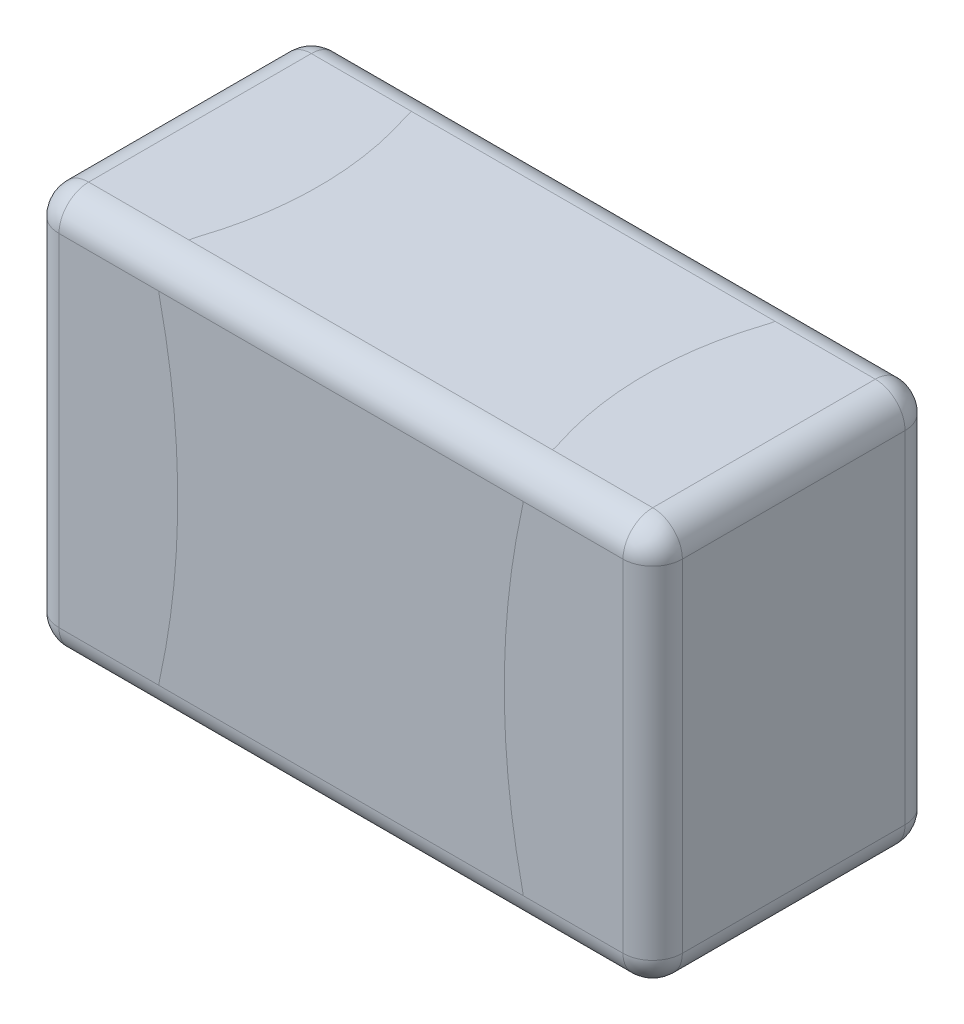
ISO-10303-21;
HEADER;
FILE_DESCRIPTION(('STEP AP214'),'2;1');
FILE_NAME('part.step','',(''),(''),'','','');
FILE_SCHEMA(('AUTOMOTIVE_DESIGN { 1 0 10303 214 1 1 1 1 }'));
ENDSEC;
DATA;
#1=APPLICATION_CONTEXT('core data for automotive mechanical design processes');
#2=APPLICATION_PROTOCOL_DEFINITION('international standard','automotive_design',2000,#1);
#3=PRODUCT_CONTEXT('',#1,'mechanical');
#4=PRODUCT('Part','Part','',(#3));
#5=PRODUCT_RELATED_PRODUCT_CATEGORY('part','',(#4));
#6=PRODUCT_DEFINITION_FORMATION('','',#4);
#7=PRODUCT_DEFINITION_CONTEXT('part definition',#1,'design');
#8=PRODUCT_DEFINITION('design','',#6,#7);
#9=PRODUCT_DEFINITION_SHAPE('','',#8);
#10=(LENGTH_UNIT() NAMED_UNIT(*) SI_UNIT(.MILLI.,.METRE.));
#11=(NAMED_UNIT(*) PLANE_ANGLE_UNIT() SI_UNIT($,.RADIAN.));
#12=(NAMED_UNIT(*) SI_UNIT($,.STERADIAN.) SOLID_ANGLE_UNIT());
#13=UNCERTAINTY_MEASURE_WITH_UNIT(LENGTH_MEASURE(1.E-05),#10,'distance_accuracy_value','');
#14=(GEOMETRIC_REPRESENTATION_CONTEXT(3) GLOBAL_UNCERTAINTY_ASSIGNED_CONTEXT((#13)) GLOBAL_UNIT_ASSIGNED_CONTEXT((#10,
#11,#12)) REPRESENTATION_CONTEXT('',''));
#15=CARTESIAN_POINT('',(0.,0.,0.));
#16=DIRECTION('',(0.,0.,1.));
#17=DIRECTION('',(1.,0.,0.));
#18=AXIS2_PLACEMENT_3D('',#15,#16,#17);
#19=CARTESIAN_POINT('',(0.95,0.575,0.85));
#20=DIRECTION('',(0.,0.,1.));
#21=DIRECTION('',(1.,0.,0.));
#22=AXIS2_PLACEMENT_3D('',#19,#20,#21);
#23=SPHERICAL_SURFACE('',#22,0.1);
#24=CARTESIAN_POINT('',(0.95,0.575,0.85));
#25=DIRECTION('',(0.,0.,-1.));
#26=DIRECTION('',(1.,0.,0.));
#27=AXIS2_PLACEMENT_3D('',#24,#25,#26);
#28=CIRCLE('',#27,0.1);
#29=CARTESIAN_POINT('',(0.95,0.675,0.85));
#30=VERTEX_POINT('',#29);
#31=CARTESIAN_POINT('',(1.05,0.575,0.85));
#32=VERTEX_POINT('',#31);
#33=EDGE_CURVE('E27',#30,#32,#28,.T.);
#34=ORIENTED_EDGE('',*,*,#33,.F.);
#35=CARTESIAN_POINT('',(0.95,0.575,0.85));
#36=DIRECTION('',(1.,0.,0.));
#37=DIRECTION('',(0.,0.,1.));
#38=AXIS2_PLACEMENT_3D('',#35,#36,#37);
#39=CIRCLE('',#38,0.1);
#40=CARTESIAN_POINT('',(0.95,0.575,0.95));
#41=VERTEX_POINT('',#40);
#42=EDGE_CURVE('E331',#30,#41,#39,.T.);
#43=ORIENTED_EDGE('',*,*,#42,.T.);
#44=CARTESIAN_POINT('',(0.95,0.575,0.85));
#45=DIRECTION('',(0.,-1.,0.));
#46=DIRECTION('',(0.,0.,1.));
#47=AXIS2_PLACEMENT_3D('',#44,#45,#46);
#48=CIRCLE('',#47,0.1);
#49=EDGE_CURVE('E11',#32,#41,#48,.T.);
#50=ORIENTED_EDGE('',*,*,#49,.F.);
#51=EDGE_LOOP('',(#34,#43,#50));
#52=FACE_BOUND('',#51,.T.);
#53=ADVANCED_FACE('F16',(#52),#23,.T.);
#54=CARTESIAN_POINT('',(-0.95,0.575,0.85));
#55=DIRECTION('',(0.,0.,1.));
#56=DIRECTION('',(0.,1.,0.));
#57=AXIS2_PLACEMENT_3D('',#54,#55,#56);
#58=SPHERICAL_SURFACE('',#57,0.1);
#59=CARTESIAN_POINT('',(-0.95,0.575,0.85));
#60=DIRECTION('',(0.,0.,-1.));
#61=DIRECTION('',(0.,1.,0.));
#62=AXIS2_PLACEMENT_3D('',#59,#60,#61);
#63=CIRCLE('',#62,0.1);
#64=CARTESIAN_POINT('',(-1.05,0.575,0.85));
#65=VERTEX_POINT('',#64);
#66=CARTESIAN_POINT('',(-0.95,0.675,0.85));
#67=VERTEX_POINT('',#66);
#68=EDGE_CURVE('E312',#65,#67,#63,.T.);
#69=ORIENTED_EDGE('',*,*,#68,.F.);
#70=CARTESIAN_POINT('',(-0.95,0.575,0.85));
#71=DIRECTION('',(0.,1.,0.));
#72=DIRECTION('',(0.,0.,1.));
#73=AXIS2_PLACEMENT_3D('',#70,#71,#72);
#74=CIRCLE('',#73,0.1);
#75=CARTESIAN_POINT('',(-0.95,0.575,0.95));
#76=VERTEX_POINT('',#75);
#77=EDGE_CURVE('E309',#65,#76,#74,.T.);
#78=ORIENTED_EDGE('',*,*,#77,.T.);
#79=CARTESIAN_POINT('',(-0.95,0.575,0.85));
#80=DIRECTION('',(1.,0.,0.));
#81=DIRECTION('',(0.,0.,1.));
#82=AXIS2_PLACEMENT_3D('',#79,#80,#81);
#83=CIRCLE('',#82,0.1);
#84=EDGE_CURVE('E313',#67,#76,#83,.T.);
#85=ORIENTED_EDGE('',*,*,#84,.F.);
#86=EDGE_LOOP('',(#69,#78,#85));
#87=FACE_BOUND('',#86,.T.);
#88=ADVANCED_FACE('F685',(#87),#58,.T.);
#89=CARTESIAN_POINT('',(0.95,-0.975,0.85));
#90=DIRECTION('',(0.,-1.,0.));
#91=DIRECTION('',(1.,0.,0.));
#92=AXIS2_PLACEMENT_3D('',#89,#90,#91);
#93=CYLINDRICAL_SURFACE('',#92,0.1);
#94=DIRECTION('',(0.,1.,0.));
#95=VECTOR('',#94,1.);
#96=CARTESIAN_POINT('',(0.95,-0.575,0.95));
#97=LINE('',#96,#95);
#98=CARTESIAN_POINT('',(0.95,-0.575,0.95));
#99=VERTEX_POINT('',#98);
#100=EDGE_CURVE('E299',#99,#41,#97,.T.);
#101=ORIENTED_EDGE('',*,*,#100,.F.);
#102=CARTESIAN_POINT('',(0.95,-0.575,0.85));
#103=DIRECTION('',(0.,-1.,0.));
#104=DIRECTION('',(0.,0.,1.));
#105=AXIS2_PLACEMENT_3D('',#102,#103,#104);
#106=CIRCLE('',#105,0.1);
#107=CARTESIAN_POINT('',(1.05,-0.575,0.85));
#108=VERTEX_POINT('',#107);
#109=EDGE_CURVE('E304',#108,#99,#106,.T.);
#110=ORIENTED_EDGE('',*,*,#109,.F.);
#111=DIRECTION('',(0.,1.,0.));
#112=VECTOR('',#111,1.);
#113=CARTESIAN_POINT('',(1.05,-0.575,0.85));
#114=LINE('',#113,#112);
#115=EDGE_CURVE('E371',#108,#32,#114,.T.);
#116=ORIENTED_EDGE('',*,*,#115,.T.);
#117=ORIENTED_EDGE('',*,*,#49,.T.);
#118=EDGE_LOOP('',(#101,#110,#116,#117));
#119=FACE_BOUND('',#118,.T.);
#120=ADVANCED_FACE('F690',(#119),#93,.T.);
#121=CARTESIAN_POINT('',(0.95,0.575,1.35));
#122=DIRECTION('',(0.,0.,-1.));
#123=DIRECTION('',(0.,1.,0.));
#124=AXIS2_PLACEMENT_3D('',#121,#122,#123);
#125=CYLINDRICAL_SURFACE('',#124,0.1);
#126=CARTESIAN_POINT('',(0.95,0.575,0.1));
#127=DIRECTION('',(0.,0.,1.));
#128=DIRECTION('',(0.,1.,0.));
#129=AXIS2_PLACEMENT_3D('',#126,#127,#128);
#130=CIRCLE('',#129,0.1);
#131=CARTESIAN_POINT('',(1.05,0.575,0.1));
#132=VERTEX_POINT('',#131);
#133=CARTESIAN_POINT('',(0.95,0.675,0.1));
#134=VERTEX_POINT('',#133);
#135=EDGE_CURVE('E372',#132,#134,#130,.T.);
#136=ORIENTED_EDGE('',*,*,#135,.T.);
#137=DIRECTION('',(0.,0.,-1.));
#138=VECTOR('',#137,1.);
#139=CARTESIAN_POINT('',(0.95,0.675,0.85));
#140=LINE('',#139,#138);
#141=EDGE_CURVE('E435',#30,#134,#140,.T.);
#142=ORIENTED_EDGE('',*,*,#141,.F.);
#143=ORIENTED_EDGE('',*,*,#33,.T.);
#144=DIRECTION('',(0.,0.,-1.));
#145=VECTOR('',#144,1.);
#146=CARTESIAN_POINT('',(1.05,0.575,0.85));
#147=LINE('',#146,#145);
#148=EDGE_CURVE('E368',#32,#132,#147,.T.);
#149=ORIENTED_EDGE('',*,*,#148,.T.);
#150=EDGE_LOOP('',(#136,#142,#143,#149));
#151=FACE_BOUND('',#150,.T.);
#152=ADVANCED_FACE('F696',(#151),#125,.T.);
#153=CARTESIAN_POINT('',(-0.95,0.575,-0.4));
#154=DIRECTION('',(0.,0.,1.));
#155=DIRECTION('',(0.,1.,0.));
#156=AXIS2_PLACEMENT_3D('',#153,#154,#155);
#157=CYLINDRICAL_SURFACE('',#156,0.1);
#158=CARTESIAN_POINT('',(-0.95,0.575,0.1));
#159=DIRECTION('',(0.,0.,1.));
#160=DIRECTION('',(-1.,0.,0.));
#161=AXIS2_PLACEMENT_3D('',#158,#159,#160);
#162=CIRCLE('',#161,0.1);
#163=CARTESIAN_POINT('',(-0.95,0.675,0.1));
#164=VERTEX_POINT('',#163);
#165=CARTESIAN_POINT('',(-1.05,0.575,0.1));
#166=VERTEX_POINT('',#165);
#167=EDGE_CURVE('E416',#164,#166,#162,.T.);
#168=ORIENTED_EDGE('',*,*,#167,.T.);
#169=DIRECTION('',(0.,0.,1.));
#170=VECTOR('',#169,1.);
#171=CARTESIAN_POINT('',(-1.05,0.575,0.1));
#172=LINE('',#171,#170);
#173=EDGE_CURVE('E420',#166,#65,#172,.T.);
#174=ORIENTED_EDGE('',*,*,#173,.T.);
#175=ORIENTED_EDGE('',*,*,#68,.T.);
#176=DIRECTION('',(0.,0.,1.));
#177=VECTOR('',#176,1.);
#178=CARTESIAN_POINT('',(-0.95,0.675,0.1));
#179=LINE('',#178,#177);
#180=EDGE_CURVE('E419',#164,#67,#179,.T.);
#181=ORIENTED_EDGE('',*,*,#180,.F.);
#182=EDGE_LOOP('',(#168,#174,#175,#181));
#183=FACE_BOUND('',#182,.T.);
#184=ADVANCED_FACE('F699',(#183),#157,.T.);
#185=CARTESIAN_POINT('',(-0.95,-0.975,0.85));
#186=DIRECTION('',(0.,-1.,0.));
#187=DIRECTION('',(0.,0.,1.));
#188=AXIS2_PLACEMENT_3D('',#185,#186,#187);
#189=CYLINDRICAL_SURFACE('',#188,0.1);
#190=DIRECTION('',(0.,1.,0.));
#191=VECTOR('',#190,1.);
#192=CARTESIAN_POINT('',(-1.05,-0.575,0.85));
#193=LINE('',#192,#191);
#194=CARTESIAN_POINT('',(-1.05,-0.575,0.85));
#195=VERTEX_POINT('',#194);
#196=EDGE_CURVE('E470',#195,#65,#193,.T.);
#197=ORIENTED_EDGE('',*,*,#196,.F.);
#198=CARTESIAN_POINT('',(-0.95,-0.575,0.85));
#199=DIRECTION('',(0.,1.,0.));
#200=DIRECTION('',(-1.,0.,0.));
#201=AXIS2_PLACEMENT_3D('',#198,#199,#200);
#202=CIRCLE('',#201,0.1);
#203=CARTESIAN_POINT('',(-0.95,-0.575,0.95));
#204=VERTEX_POINT('',#203);
#205=EDGE_CURVE('E474',#195,#204,#202,.T.);
#206=ORIENTED_EDGE('',*,*,#205,.T.);
#207=DIRECTION('',(0.,1.,0.));
#208=VECTOR('',#207,1.);
#209=CARTESIAN_POINT('',(-0.95,-0.575,0.95));
#210=LINE('',#209,#208);
#211=EDGE_CURVE('E277',#204,#76,#210,.T.);
#212=ORIENTED_EDGE('',*,*,#211,.T.);
#213=ORIENTED_EDGE('',*,*,#77,.F.);
#214=EDGE_LOOP('',(#197,#206,#212,#213));
#215=FACE_BOUND('',#214,.T.);
#216=ADVANCED_FACE('F650',(#215),#189,.T.);
#217=CARTESIAN_POINT('',(-1.35,0.575,0.85));
#218=DIRECTION('',(1.,0.,0.));
#219=DIRECTION('',(0.,1.,0.));
#220=AXIS2_PLACEMENT_3D('',#217,#218,#219);
#221=CYLINDRICAL_SURFACE('',#220,0.1);
#222=DIRECTION('',(1.,0.,0.));
#223=VECTOR('',#222,1.);
#224=CARTESIAN_POINT('',(-0.613766216345116,0.575,0.95));
#225=LINE('',#224,#223);
#226=CARTESIAN_POINT('',(-0.613766217860381,0.575000000161156,0.95));
#227=VERTEX_POINT('',#226);
#228=CARTESIAN_POINT('',(0.613766217734058,0.575000000162141,0.95));
#229=VERTEX_POINT('',#228);
#230=EDGE_CURVE('E318',#227,#229,#225,.T.);
#231=ORIENTED_EDGE('',*,*,#230,.T.);
#232=DIRECTION('',(1.,0.,0.));
#233=VECTOR('',#232,1.);
#234=CARTESIAN_POINT('',(0.613767345066621,0.575,0.95));
#235=LINE('',#234,#233);
#236=EDGE_CURVE('E303',#229,#41,#235,.T.);
#237=ORIENTED_EDGE('',*,*,#236,.T.);
#238=ORIENTED_EDGE('',*,*,#42,.F.);
#239=DIRECTION('',(1.,0.,0.));
#240=VECTOR('',#239,1.);
#241=CARTESIAN_POINT('',(0.61222652541798,0.675,0.85));
#242=LINE('',#241,#240);
#243=CARTESIAN_POINT('',(0.612225614374475,0.675,0.850000000332777));
#244=VERTEX_POINT('',#243);
#245=EDGE_CURVE('E439',#244,#30,#242,.T.);
#246=ORIENTED_EDGE('',*,*,#245,.F.);
#247=DIRECTION('',(1.,0.,0.));
#248=VECTOR('',#247,1.);
#249=CARTESIAN_POINT('',(-0.61222561240207,0.675,0.85));
#250=LINE('',#249,#248);
#251=CARTESIAN_POINT('',(-0.612225614631557,0.675,0.850000000337919));
#252=VERTEX_POINT('',#251);
#253=EDGE_CURVE('E423',#252,#244,#250,.T.);
#254=ORIENTED_EDGE('',*,*,#253,.F.);
#255=DIRECTION('',(1.,0.,0.));
#256=VECTOR('',#255,1.);
#257=CARTESIAN_POINT('',(-0.95,0.675,0.85));
#258=LINE('',#257,#256);
#259=EDGE_CURVE('E440',#67,#252,#258,.T.);
#260=ORIENTED_EDGE('',*,*,#259,.F.);
#261=ORIENTED_EDGE('',*,*,#84,.T.);
#262=DIRECTION('',(1.,0.,0.));
#263=VECTOR('',#262,1.);
#264=CARTESIAN_POINT('',(-0.95,0.575,0.95));
#265=LINE('',#264,#263);
#266=EDGE_CURVE('E269',#76,#227,#265,.T.);
#267=ORIENTED_EDGE('',*,*,#266,.T.);
#268=EDGE_LOOP('',(#231,#237,#238,#246,#254,#260,#261,#267));
#269=FACE_BOUND('',#268,.T.);
#270=ADVANCED_FACE('F642',(#269),#221,.T.);
#271=CARTESIAN_POINT('',(-1.05,-0.675,0.95));
#272=DIRECTION('',(0.,0.,1.));
#273=DIRECTION('',(1.,0.,0.));
#274=AXIS2_PLACEMENT_3D('',#271,#272,#273);
#275=PLANE('',#274);
#276=CARTESIAN_POINT('',(0.415000000043602,-0.597180878357803,0.95));
#277=DIRECTION('',(0.,0.,1.));
#278=DIRECTION('',(0.993831080154927,0.110904391789016,0.));
#279=AXIS2_PLACEMENT_3D('',#276,#277,#278);
#280=CIRCLE('',#279,0.2);
#281=CARTESIAN_POINT('',(0.613766217595116,-0.575000000161716,0.95));
#282=VERTEX_POINT('',#281);
#283=CARTESIAN_POINT('',(0.610316613749289,-0.554152742734599,0.95));
#284=VERTEX_POINT('',#283);
#285=EDGE_CURVE('E463',#282,#284,#280,.T.);
#286=ORIENTED_EDGE('',*,*,#285,.F.);
#287=DIRECTION('',(1.,0.,0.));
#288=VECTOR('',#287,1.);
#289=CARTESIAN_POINT('',(0.613767341970685,-0.575,0.95));
#290=LINE('',#289,#288);
#291=EDGE_CURVE('E20',#282,#99,#290,.T.);
#292=ORIENTED_EDGE('',*,*,#291,.T.);
#293=ORIENTED_EDGE('',*,*,#100,.T.);
#294=ORIENTED_EDGE('',*,*,#236,.F.);
#295=CARTESIAN_POINT('',(0.415000000043602,0.597180877148546,0.95));
#296=DIRECTION('',(0.,0.,1.));
#297=DIRECTION('',(0.976583067458364,-0.215140680378239,0.));
#298=AXIS2_PLACEMENT_3D('',#295,#296,#297);
#299=CIRCLE('',#298,0.2);
#300=CARTESIAN_POINT('',(0.610316613517289,0.554152741076861,0.95));
#301=VERTEX_POINT('',#300);
#302=EDGE_CURVE('E314',#301,#229,#299,.T.);
#303=ORIENTED_EDGE('',*,*,#302,.F.);
#304=CARTESIAN_POINT('',(3.12576923076923,0.,0.95));
#305=DIRECTION('',(0.,0.,-1.));
#306=DIRECTION('',(-0.976583067637498,-0.215140679565103,0.));
#307=AXIS2_PLACEMENT_3D('',#304,#305,#306);
#308=CIRCLE('',#307,2.57576923076923);
#309=EDGE_CURVE('E319',#284,#301,#308,.T.);
#310=ORIENTED_EDGE('',*,*,#309,.F.);
#311=EDGE_LOOP('',(#286,#292,#293,#294,#303,#310));
#312=FACE_BOUND('',#311,.T.);
#313=ADVANCED_FACE('F723',(#312),#275,.T.);
#314=CARTESIAN_POINT('',(0.95,-0.575,0.85));
#315=DIRECTION('',(0.,0.,1.));
#316=DIRECTION('',(0.,-1.,0.));
#317=AXIS2_PLACEMENT_3D('',#314,#315,#316);
#318=SPHERICAL_SURFACE('',#317,0.1);
#319=ORIENTED_EDGE('',*,*,#109,.T.);
#320=CARTESIAN_POINT('',(0.95,-0.575,0.85));
#321=DIRECTION('',(-1.,0.,0.));
#322=DIRECTION('',(0.,0.,1.));
#323=AXIS2_PLACEMENT_3D('',#320,#321,#322);
#324=CIRCLE('',#323,0.1);
#325=CARTESIAN_POINT('',(0.95,-0.675,0.85));
#326=VERTEX_POINT('',#325);
#327=EDGE_CURVE('E294',#326,#99,#324,.T.);
#328=ORIENTED_EDGE('',*,*,#327,.F.);
#329=CARTESIAN_POINT('',(0.95,-0.575,0.85));
#330=DIRECTION('',(0.,0.,-1.));
#331=DIRECTION('',(0.,-1.,0.));
#332=AXIS2_PLACEMENT_3D('',#329,#330,#331);
#333=CIRCLE('',#332,0.1);
#334=EDGE_CURVE('E480',#108,#326,#333,.T.);
#335=ORIENTED_EDGE('',*,*,#334,.F.);
#336=EDGE_LOOP('',(#319,#328,#335));
#337=FACE_BOUND('',#336,.T.);
#338=ADVANCED_FACE('F748',(#337),#318,.T.);
#339=CARTESIAN_POINT('',(1.05,-0.675,0.95));
#340=DIRECTION('',(1.,0.,0.));
#341=DIRECTION('',(0.,1.,0.));
#342=AXIS2_PLACEMENT_3D('',#339,#340,#341);
#343=PLANE('',#342);
#344=DIRECTION('',(0.,1.,0.));
#345=VECTOR('',#344,1.);
#346=CARTESIAN_POINT('',(1.05,-0.575,0.1));
#347=LINE('',#346,#345);
#348=CARTESIAN_POINT('',(1.05,-0.575,0.1));
#349=VERTEX_POINT('',#348);
#350=EDGE_CURVE('E323',#349,#132,#347,.T.);
#351=ORIENTED_EDGE('',*,*,#350,.T.);
#352=ORIENTED_EDGE('',*,*,#148,.F.);
#353=ORIENTED_EDGE('',*,*,#115,.F.);
#354=DIRECTION('',(0.,0.,-1.));
#355=VECTOR('',#354,1.);
#356=CARTESIAN_POINT('',(1.05,-0.575,0.85));
#357=LINE('',#356,#355);
#358=EDGE_CURVE('E393',#108,#349,#357,.T.);
#359=ORIENTED_EDGE('',*,*,#358,.T.);
#360=EDGE_LOOP('',(#351,#352,#353,#359));
#361=FACE_BOUND('',#360,.T.);
#362=ADVANCED_FACE('F1136',(#361),#343,.T.);
#363=CARTESIAN_POINT('',(0.95,0.575,0.1));
#364=DIRECTION('',(0.,0.,-1.));
#365=DIRECTION('',(0.,1.,0.));
#366=AXIS2_PLACEMENT_3D('',#363,#364,#365);
#367=SPHERICAL_SURFACE('',#366,0.1);
#368=CARTESIAN_POINT('',(0.95,0.575,0.1));
#369=DIRECTION('',(0.,1.,0.));
#370=DIRECTION('',(0.,0.,-1.));
#371=AXIS2_PLACEMENT_3D('',#368,#369,#370);
#372=CIRCLE('',#371,0.1);
#373=CARTESIAN_POINT('',(0.95,0.575,0.));
#374=VERTEX_POINT('',#373);
#375=EDGE_CURVE('E327',#132,#374,#372,.T.);
#376=ORIENTED_EDGE('',*,*,#375,.T.);
#377=CARTESIAN_POINT('',(0.95,0.575,0.1));
#378=DIRECTION('',(-1.,0.,0.));
#379=DIRECTION('',(0.,0.,-1.));
#380=AXIS2_PLACEMENT_3D('',#377,#378,#379);
#381=CIRCLE('',#380,0.1);
#382=EDGE_CURVE('E375',#134,#374,#381,.T.);
#383=ORIENTED_EDGE('',*,*,#382,.F.);
#384=ORIENTED_EDGE('',*,*,#135,.F.);
#385=EDGE_LOOP('',(#376,#383,#384));
#386=FACE_BOUND('',#385,.T.);
#387=ADVANCED_FACE('F704',(#386),#367,.T.);
#388=CARTESIAN_POINT('',(0.,0.675,0.));
#389=DIRECTION('',(0.,1.,0.));
#390=DIRECTION('',(1.,0.,0.));
#391=AXIS2_PLACEMENT_3D('',#388,#389,#390);
#392=PLANE('',#391);
#393=CARTESIAN_POINT('',(0.414999999998827,0.675,0.0668027437069124));
#394=DIRECTION('',(0.,-1.,0.));
#395=DIRECTION('',(0.9861280618486,0.,0.165986281465438));
#396=AXIS2_PLACEMENT_3D('',#393,#394,#395);
#397=CIRCLE('',#396,0.2);
#398=CARTESIAN_POINT('',(0.612225614598033,0.675,0.0999999996620809));
#399=VERTEX_POINT('',#398);
#400=CARTESIAN_POINT('',(0.60510828215951,0.675,0.128922314355596));
#401=VERTEX_POINT('',#400);
#402=EDGE_CURVE('E411',#399,#401,#397,.T.);
#403=ORIENTED_EDGE('',*,*,#402,.T.);
#404=CARTESIAN_POINT('',(1.66423076923077,0.675,0.475));
#405=DIRECTION('',(0.,1.,0.));
#406=DIRECTION('',(-0.950541410549756,0.,-0.310597853872301));
#407=AXIS2_PLACEMENT_3D('',#404,#405,#406);
#408=CIRCLE('',#407,1.11423076923077);
#409=CARTESIAN_POINT('',(0.6051082823478,0.675,0.821077686783946));
#410=VERTEX_POINT('',#409);
#411=EDGE_CURVE('E414',#401,#410,#408,.T.);
#412=ORIENTED_EDGE('',*,*,#411,.T.);
#413=CARTESIAN_POINT('',(0.414999999998827,0.675,0.883197257419703));
#414=DIRECTION('',(0.,-1.,0.));
#415=DIRECTION('',(0.950541410869801,0.,-0.31059785289285));
#416=AXIS2_PLACEMENT_3D('',#413,#414,#415);
#417=CIRCLE('',#416,0.2);
#418=EDGE_CURVE('E427',#410,#244,#417,.T.);
#419=ORIENTED_EDGE('',*,*,#418,.T.);
#420=ORIENTED_EDGE('',*,*,#245,.T.);
#421=ORIENTED_EDGE('',*,*,#141,.T.);
#422=DIRECTION('',(-1.,0.,0.));
#423=VECTOR('',#422,1.);
#424=CARTESIAN_POINT('',(0.95,0.675,0.1));
#425=LINE('',#424,#423);
#426=EDGE_CURVE('E390',#134,#399,#425,.T.);
#427=ORIENTED_EDGE('',*,*,#426,.T.);
#428=EDGE_LOOP('',(#403,#412,#419,#420,#421,#427));
#429=FACE_BOUND('',#428,.T.);
#430=ADVANCED_FACE('F701',(#429),#392,.T.);
#431=CARTESIAN_POINT('',(0.,0.675,0.));
#432=DIRECTION('',(0.,1.,0.));
#433=DIRECTION('',(1.,0.,0.));
#434=AXIS2_PLACEMENT_3D('',#431,#432,#433);
#435=PLANE('',#434);
#436=CARTESIAN_POINT('',(-0.415000000031313,0.675,0.883197256286924));
#437=DIRECTION('',(0.,-1.,0.));
#438=DIRECTION('',(-0.986128061853787,0.,-0.165986281434622));
#439=AXIS2_PLACEMENT_3D('',#436,#437,#438);
#440=CIRCLE('',#439,0.2);
#441=CARTESIAN_POINT('',(-0.605108282081708,0.675,0.821077685353512));
#442=VERTEX_POINT('',#441);
#443=EDGE_CURVE('E428',#252,#442,#440,.T.);
#444=ORIENTED_EDGE('',*,*,#443,.T.);
#445=CARTESIAN_POINT('',(-1.66423076923077,0.675,0.475));
#446=DIRECTION('',(0.,1.,0.));
#447=DIRECTION('',(0.95054141063357,0.,0.310597853615802));
#448=AXIS2_PLACEMENT_3D('',#445,#446,#447);
#449=CIRCLE('',#448,1.11423076923077);
#450=CARTESIAN_POINT('',(-0.6051082825548,0.675,0.128922312122949));
#451=VERTEX_POINT('',#450);
#452=EDGE_CURVE('E465',#442,#451,#449,.T.);
#453=ORIENTED_EDGE('',*,*,#452,.T.);
#454=CARTESIAN_POINT('',(-0.415000000031312,0.675,0.0668027415616645));
#455=DIRECTION('',(0.,-1.,0.));
#456=DIRECTION('',(-0.950541411063914,0.,0.310597852298795));
#457=AXIS2_PLACEMENT_3D('',#454,#455,#456);
#458=CIRCLE('',#457,0.2);
#459=CARTESIAN_POINT('',(-0.612225614235502,0.675,0.0999999996672228));
#460=VERTEX_POINT('',#459);
#461=EDGE_CURVE('E413',#451,#460,#458,.T.);
#462=ORIENTED_EDGE('',*,*,#461,.T.);
#463=DIRECTION('',(-1.,0.,0.));
#464=VECTOR('',#463,1.);
#465=CARTESIAN_POINT('',(-0.612226525278894,0.675,0.1));
#466=LINE('',#465,#464);
#467=EDGE_CURVE('E385',#460,#164,#466,.T.);
#468=ORIENTED_EDGE('',*,*,#467,.T.);
#469=ORIENTED_EDGE('',*,*,#180,.T.);
#470=ORIENTED_EDGE('',*,*,#259,.T.);
#471=EDGE_LOOP('',(#444,#453,#462,#468,#469,#470));
#472=FACE_BOUND('',#471,.T.);
#473=ADVANCED_FACE('F695',(#472),#435,.T.);
#474=CARTESIAN_POINT('',(-0.95,0.575,0.1));
#475=DIRECTION('',(0.,0.,-1.));
#476=DIRECTION('',(-1.,0.,0.));
#477=AXIS2_PLACEMENT_3D('',#474,#475,#476);
#478=SPHERICAL_SURFACE('',#477,0.1);
#479=CARTESIAN_POINT('',(-0.95,0.575,0.1));
#480=DIRECTION('',(-1.,0.,0.));
#481=DIRECTION('',(0.,0.,-1.));
#482=AXIS2_PLACEMENT_3D('',#479,#480,#481);
#483=CIRCLE('',#482,0.1);
#484=CARTESIAN_POINT('',(-0.95,0.575,0.));
#485=VERTEX_POINT('',#484);
#486=EDGE_CURVE('E382',#164,#485,#483,.T.);
#487=ORIENTED_EDGE('',*,*,#486,.T.);
#488=CARTESIAN_POINT('',(-0.95,0.575,0.1));
#489=DIRECTION('',(0.,-1.,0.));
#490=DIRECTION('',(0.,0.,-1.));
#491=AXIS2_PLACEMENT_3D('',#488,#489,#490);
#492=CIRCLE('',#491,0.1);
#493=EDGE_CURVE('E78',#166,#485,#492,.T.);
#494=ORIENTED_EDGE('',*,*,#493,.F.);
#495=ORIENTED_EDGE('',*,*,#167,.F.);
#496=EDGE_LOOP('',(#487,#494,#495));
#497=FACE_BOUND('',#496,.T.);
#498=ADVANCED_FACE('F658',(#497),#478,.T.);
#499=CARTESIAN_POINT('',(-1.05,-0.675,0.));
#500=DIRECTION('',(-1.,0.,0.));
#501=DIRECTION('',(0.,0.,1.));
#502=AXIS2_PLACEMENT_3D('',#499,#500,#501);
#503=PLANE('',#502);
#504=DIRECTION('',(0.,1.,0.));
#505=VECTOR('',#504,1.);
#506=CARTESIAN_POINT('',(-1.05,-0.575,0.1));
#507=LINE('',#506,#505);
#508=CARTESIAN_POINT('',(-1.05,-0.575,0.1));
#509=VERTEX_POINT('',#508);
#510=EDGE_CURVE('E93',#509,#166,#507,.T.);
#511=ORIENTED_EDGE('',*,*,#510,.F.);
#512=DIRECTION('',(0.,0.,1.));
#513=VECTOR('',#512,1.);
#514=CARTESIAN_POINT('',(-1.05,-0.575,0.1));
#515=LINE('',#514,#513);
#516=EDGE_CURVE('E305',#509,#195,#515,.T.);
#517=ORIENTED_EDGE('',*,*,#516,.T.);
#518=ORIENTED_EDGE('',*,*,#196,.T.);
#519=ORIENTED_EDGE('',*,*,#173,.F.);
#520=EDGE_LOOP('',(#511,#517,#518,#519));
#521=FACE_BOUND('',#520,.T.);
#522=ADVANCED_FACE('F654',(#521),#503,.T.);
#523=CARTESIAN_POINT('',(-0.95,-0.575,0.85));
#524=DIRECTION('',(0.,0.,1.));
#525=DIRECTION('',(-1.,0.,0.));
#526=AXIS2_PLACEMENT_3D('',#523,#524,#525);
#527=SPHERICAL_SURFACE('',#526,0.1);
#528=ORIENTED_EDGE('',*,*,#205,.F.);
#529=CARTESIAN_POINT('',(-0.95,-0.575,0.85));
#530=DIRECTION('',(0.,0.,-1.));
#531=DIRECTION('',(-1.,0.,0.));
#532=AXIS2_PLACEMENT_3D('',#529,#530,#531);
#533=CIRCLE('',#532,0.1);
#534=CARTESIAN_POINT('',(-0.95,-0.675,0.85));
#535=VERTEX_POINT('',#534);
#536=EDGE_CURVE('E308',#535,#195,#533,.T.);
#537=ORIENTED_EDGE('',*,*,#536,.F.);
#538=CARTESIAN_POINT('',(-0.95,-0.575,0.85));
#539=DIRECTION('',(-1.,0.,0.));
#540=DIRECTION('',(0.,0.,1.));
#541=AXIS2_PLACEMENT_3D('',#538,#539,#540);
#542=CIRCLE('',#541,0.1);
#543=EDGE_CURVE('E282',#535,#204,#542,.T.);
#544=ORIENTED_EDGE('',*,*,#543,.T.);
#545=EDGE_LOOP('',(#528,#537,#544));
#546=FACE_BOUND('',#545,.T.);
#547=ADVANCED_FACE('F653',(#546),#527,.T.);
#548=CARTESIAN_POINT('',(-1.05,-0.675,0.95));
#549=DIRECTION('',(0.,0.,1.));
#550=DIRECTION('',(1.,0.,0.));
#551=AXIS2_PLACEMENT_3D('',#548,#549,#550);
#552=PLANE('',#551);
#553=CARTESIAN_POINT('',(-0.415000000002069,-0.597180877121063,0.95));
#554=DIRECTION('',(0.,0.,-1.));
#555=DIRECTION('',(-0.993831080844983,0.110904385605315,0.));
#556=AXIS2_PLACEMENT_3D('',#553,#554,#555);
#557=CIRCLE('',#556,0.2);
#558=CARTESIAN_POINT('',(-0.613766217688978,-0.575000000161438,0.95));
#559=VERTEX_POINT('',#558);
#560=CARTESIAN_POINT('',(-0.610316613528899,-0.554152741210082,0.95));
#561=VERTEX_POINT('',#560);
#562=EDGE_CURVE('E257',#559,#561,#557,.T.);
#563=ORIENTED_EDGE('',*,*,#562,.T.);
#564=CARTESIAN_POINT('',(-3.12576923076923,0.,0.95));
#565=DIRECTION('',(0.,0.,1.));
#566=DIRECTION('',(0.976583067765811,-0.215140678982653,0.));
#567=AXIS2_PLACEMENT_3D('',#564,#565,#566);
#568=CIRCLE('',#567,2.57576923076923);
#569=CARTESIAN_POINT('',(-0.610316613313216,0.554152739451194,0.95));
#570=VERTEX_POINT('',#569);
#571=EDGE_CURVE('E266',#561,#570,#568,.T.);
#572=ORIENTED_EDGE('',*,*,#571,.T.);
#573=CARTESIAN_POINT('',(-0.415000000002069,0.597180875561375,0.95));
#574=DIRECTION('',(0.,0.,-1.));
#575=DIRECTION('',(-0.976583067380308,-0.215140680732559,0.));
#576=AXIS2_PLACEMENT_3D('',#573,#574,#575);
#577=CIRCLE('',#576,0.2);
#578=EDGE_CURVE('E404',#570,#227,#577,.T.);
#579=ORIENTED_EDGE('',*,*,#578,.T.);
#580=ORIENTED_EDGE('',*,*,#266,.F.);
#581=ORIENTED_EDGE('',*,*,#211,.F.);
#582=DIRECTION('',(1.,0.,0.));
#583=VECTOR('',#582,1.);
#584=CARTESIAN_POINT('',(-0.95,-0.575,0.95));
#585=LINE('',#584,#583);
#586=EDGE_CURVE('E273',#204,#559,#585,.T.);
#587=ORIENTED_EDGE('',*,*,#586,.T.);
#588=EDGE_LOOP('',(#563,#572,#579,#580,#581,#587));
#589=FACE_BOUND('',#588,.T.);
#590=ADVANCED_FACE('F274',(#589),#552,.T.);
#591=CARTESIAN_POINT('',(-1.05,-0.675,0.95));
#592=DIRECTION('',(0.,0.,1.));
#593=DIRECTION('',(1.,0.,0.));
#594=AXIS2_PLACEMENT_3D('',#591,#592,#593);
#595=PLANE('',#594);
#596=ORIENTED_EDGE('',*,*,#285,.T.);
#597=ORIENTED_EDGE('',*,*,#309,.T.);
#598=ORIENTED_EDGE('',*,*,#302,.T.);
#599=ORIENTED_EDGE('',*,*,#230,.F.);
#600=ORIENTED_EDGE('',*,*,#578,.F.);
#601=ORIENTED_EDGE('',*,*,#571,.F.);
#602=ORIENTED_EDGE('',*,*,#562,.F.);
#603=DIRECTION('',(1.,0.,0.));
#604=VECTOR('',#603,1.);
#605=CARTESIAN_POINT('',(-0.613766216171066,-0.575,0.95));
#606=LINE('',#605,#604);
#607=EDGE_CURVE('E262',#559,#282,#606,.T.);
#608=ORIENTED_EDGE('',*,*,#607,.T.);
#609=EDGE_LOOP('',(#596,#597,#598,#599,#600,#601,#602,#608));
#610=FACE_BOUND('',#609,.T.);
#611=ADVANCED_FACE('F260',(#610),#595,.T.);
#612=CARTESIAN_POINT('',(0.,0.675,0.));
#613=DIRECTION('',(0.,1.,0.));
#614=DIRECTION('',(1.,0.,0.));
#615=AXIS2_PLACEMENT_3D('',#612,#613,#614);
#616=PLANE('',#615);
#617=ORIENTED_EDGE('',*,*,#443,.F.);
#618=ORIENTED_EDGE('',*,*,#253,.T.);
#619=ORIENTED_EDGE('',*,*,#418,.F.);
#620=ORIENTED_EDGE('',*,*,#411,.F.);
#621=ORIENTED_EDGE('',*,*,#402,.F.);
#622=DIRECTION('',(-1.,0.,0.));
#623=VECTOR('',#622,1.);
#624=CARTESIAN_POINT('',(0.612225612368547,0.675,0.1));
#625=LINE('',#624,#623);
#626=EDGE_CURVE('E432',#399,#460,#625,.T.);
#627=ORIENTED_EDGE('',*,*,#626,.T.);
#628=ORIENTED_EDGE('',*,*,#461,.F.);
#629=ORIENTED_EDGE('',*,*,#452,.F.);
#630=EDGE_LOOP('',(#617,#618,#619,#620,#621,#627,#628,#629));
#631=FACE_BOUND('',#630,.T.);
#632=ADVANCED_FACE('F733',(#631),#616,.T.);
#633=CARTESIAN_POINT('',(0.95,-0.575,1.35));
#634=DIRECTION('',(0.,0.,1.));
#635=DIRECTION('',(0.,-1.,0.));
#636=AXIS2_PLACEMENT_3D('',#633,#634,#635);
#637=CYLINDRICAL_SURFACE('',#636,0.1);
#638=CARTESIAN_POINT('',(0.95,-0.575,0.1));
#639=DIRECTION('',(0.,0.,1.));
#640=DIRECTION('',(1.,0.,0.));
#641=AXIS2_PLACEMENT_3D('',#638,#639,#640);
#642=CIRCLE('',#641,0.1);
#643=CARTESIAN_POINT('',(0.95,-0.675,0.1));
#644=VERTEX_POINT('',#643);
#645=EDGE_CURVE('E405',#644,#349,#642,.T.);
#646=ORIENTED_EDGE('',*,*,#645,.T.);
#647=ORIENTED_EDGE('',*,*,#358,.F.);
#648=ORIENTED_EDGE('',*,*,#334,.T.);
#649=DIRECTION('',(0.,0.,-1.));
#650=VECTOR('',#649,1.);
#651=CARTESIAN_POINT('',(0.95,-0.675,0.85));
#652=LINE('',#651,#650);
#653=EDGE_CURVE('E455',#326,#644,#652,.T.);
#654=ORIENTED_EDGE('',*,*,#653,.T.);
#655=EDGE_LOOP('',(#646,#647,#648,#654));
#656=FACE_BOUND('',#655,.T.);
#657=ADVANCED_FACE('F730',(#656),#637,.T.);
#658=CARTESIAN_POINT('',(0.95,-0.975,0.1));
#659=DIRECTION('',(0.,-1.,0.));
#660=DIRECTION('',(0.,0.,-1.));
#661=AXIS2_PLACEMENT_3D('',#658,#659,#660);
#662=CYLINDRICAL_SURFACE('',#661,0.1);
#663=ORIENTED_EDGE('',*,*,#350,.F.);
#664=CARTESIAN_POINT('',(0.95,-0.575,0.1));
#665=DIRECTION('',(0.,1.,0.));
#666=DIRECTION('',(1.,0.,0.));
#667=AXIS2_PLACEMENT_3D('',#664,#665,#666);
#668=CIRCLE('',#667,0.1);
#669=CARTESIAN_POINT('',(0.95,-0.575,0.));
#670=VERTEX_POINT('',#669);
#671=EDGE_CURVE('E409',#349,#670,#668,.T.);
#672=ORIENTED_EDGE('',*,*,#671,.T.);
#673=DIRECTION('',(0.,1.,0.));
#674=VECTOR('',#673,1.);
#675=CARTESIAN_POINT('',(0.95,-0.575,0.));
#676=LINE('',#675,#674);
#677=EDGE_CURVE('E410',#670,#374,#676,.T.);
#678=ORIENTED_EDGE('',*,*,#677,.T.);
#679=ORIENTED_EDGE('',*,*,#375,.F.);
#680=EDGE_LOOP('',(#663,#672,#678,#679));
#681=FACE_BOUND('',#680,.T.);
#682=ADVANCED_FACE('F732',(#681),#662,.T.);
#683=CARTESIAN_POINT('',(-0.95,-0.975,0.1));
#684=DIRECTION('',(0.,-1.,0.));
#685=DIRECTION('',(-1.,0.,0.));
#686=AXIS2_PLACEMENT_3D('',#683,#684,#685);
#687=CYLINDRICAL_SURFACE('',#686,0.1);
#688=DIRECTION('',(0.,1.,0.));
#689=VECTOR('',#688,1.);
#690=CARTESIAN_POINT('',(-0.95,-0.575,0.));
#691=LINE('',#690,#689);
#692=CARTESIAN_POINT('',(-0.95,-0.575,0.));
#693=VERTEX_POINT('',#692);
#694=EDGE_CURVE('E454',#693,#485,#691,.T.);
#695=ORIENTED_EDGE('',*,*,#694,.F.);
#696=CARTESIAN_POINT('',(-0.95,-0.575,0.1));
#697=DIRECTION('',(0.,-1.,0.));
#698=DIRECTION('',(0.,0.,-1.));
#699=AXIS2_PLACEMENT_3D('',#696,#697,#698);
#700=CIRCLE('',#699,0.1);
#701=EDGE_CURVE('E529',#509,#693,#700,.T.);
#702=ORIENTED_EDGE('',*,*,#701,.F.);
#703=ORIENTED_EDGE('',*,*,#510,.T.);
#704=ORIENTED_EDGE('',*,*,#493,.T.);
#705=EDGE_LOOP('',(#695,#702,#703,#704));
#706=FACE_BOUND('',#705,.T.);
#707=ADVANCED_FACE('F661',(#706),#687,.T.);
#708=CARTESIAN_POINT('',(-0.95,-0.575,-0.4));
#709=DIRECTION('',(0.,0.,-1.));
#710=DIRECTION('',(0.,-1.,0.));
#711=AXIS2_PLACEMENT_3D('',#708,#709,#710);
#712=CYLINDRICAL_SURFACE('',#711,0.1);
#713=CARTESIAN_POINT('',(-0.95,-0.575,0.1));
#714=DIRECTION('',(0.,0.,1.));
#715=DIRECTION('',(0.,-1.,0.));
#716=AXIS2_PLACEMENT_3D('',#713,#714,#715);
#717=CIRCLE('',#716,0.1);
#718=CARTESIAN_POINT('',(-0.95,-0.675,0.1));
#719=VERTEX_POINT('',#718);
#720=EDGE_CURVE('E297',#509,#719,#717,.T.);
#721=ORIENTED_EDGE('',*,*,#720,.T.);
#722=DIRECTION('',(0.,0.,1.));
#723=VECTOR('',#722,1.);
#724=CARTESIAN_POINT('',(-0.95,-0.675,0.1));
#725=LINE('',#724,#723);
#726=EDGE_CURVE('E396',#719,#535,#725,.T.);
#727=ORIENTED_EDGE('',*,*,#726,.T.);
#728=ORIENTED_EDGE('',*,*,#536,.T.);
#729=ORIENTED_EDGE('',*,*,#516,.F.);
#730=EDGE_LOOP('',(#721,#727,#728,#729));
#731=FACE_BOUND('',#730,.T.);
#732=ADVANCED_FACE('F18',(#731),#712,.T.);
#733=CARTESIAN_POINT('',(-1.35,-0.575,0.85));
#734=DIRECTION('',(-1.,0.,0.));
#735=DIRECTION('',(0.,-1.,0.));
#736=AXIS2_PLACEMENT_3D('',#733,#734,#735);
#737=CYLINDRICAL_SURFACE('',#736,0.1);
#738=DIRECTION('',(1.,0.,0.));
#739=VECTOR('',#738,1.);
#740=CARTESIAN_POINT('',(-0.61222561240207,-0.675,0.85));
#741=LINE('',#740,#739);
#742=CARTESIAN_POINT('',(-0.612225614597695,-0.675,0.850000000332787));
#743=VERTEX_POINT('',#742);
#744=CARTESIAN_POINT('',(0.612225614331373,-0.675,0.850000000326244));
#745=VERTEX_POINT('',#744);
#746=EDGE_CURVE('E340',#743,#745,#741,.T.);
#747=ORIENTED_EDGE('',*,*,#746,.T.);
#748=DIRECTION('',(1.,0.,0.));
#749=VECTOR('',#748,1.);
#750=CARTESIAN_POINT('',(0.612226507489683,-0.675,0.85));
#751=LINE('',#750,#749);
#752=EDGE_CURVE('E386',#745,#326,#751,.T.);
#753=ORIENTED_EDGE('',*,*,#752,.T.);
#754=ORIENTED_EDGE('',*,*,#327,.T.);
#755=ORIENTED_EDGE('',*,*,#291,.F.);
#756=ORIENTED_EDGE('',*,*,#607,.F.);
#757=ORIENTED_EDGE('',*,*,#586,.F.);
#758=ORIENTED_EDGE('',*,*,#543,.F.);
#759=DIRECTION('',(1.,0.,0.));
#760=VECTOR('',#759,1.);
#761=CARTESIAN_POINT('',(-0.95,-0.675,0.85));
#762=LINE('',#761,#760);
#763=EDGE_CURVE('E342',#535,#743,#762,.T.);
#764=ORIENTED_EDGE('',*,*,#763,.T.);
#765=EDGE_LOOP('',(#747,#753,#754,#755,#756,#757,#758,#764));
#766=FACE_BOUND('',#765,.T.);
#767=ADVANCED_FACE('F285',(#766),#737,.T.);
#768=CARTESIAN_POINT('',(1.35,0.575,0.1));
#769=DIRECTION('',(-1.,0.,0.));
#770=DIRECTION('',(0.,1.,0.));
#771=AXIS2_PLACEMENT_3D('',#768,#769,#770);
#772=CYLINDRICAL_SURFACE('',#771,0.1);
#773=DIRECTION('',(-1.,0.,0.));
#774=VECTOR('',#773,1.);
#775=CARTESIAN_POINT('',(0.613766216209532,0.575,0.));
#776=LINE('',#775,#774);
#777=CARTESIAN_POINT('',(0.613766217724797,0.575000000161156,0.));
#778=VERTEX_POINT('',#777);
#779=CARTESIAN_POINT('',(-0.613766217869642,0.575000000162141,0.));
#780=VERTEX_POINT('',#779);
#781=EDGE_CURVE('E381',#778,#780,#776,.T.);
#782=ORIENTED_EDGE('',*,*,#781,.T.);
#783=DIRECTION('',(-1.,0.,0.));
#784=VECTOR('',#783,1.);
#785=CARTESIAN_POINT('',(-0.613767345202103,0.575,0.));
#786=LINE('',#785,#784);
#787=EDGE_CURVE('E449',#780,#485,#786,.T.);
#788=ORIENTED_EDGE('',*,*,#787,.T.);
#789=ORIENTED_EDGE('',*,*,#486,.F.);
#790=ORIENTED_EDGE('',*,*,#467,.F.);
#791=ORIENTED_EDGE('',*,*,#626,.F.);
#792=ORIENTED_EDGE('',*,*,#426,.F.);
#793=ORIENTED_EDGE('',*,*,#382,.T.);
#794=DIRECTION('',(-1.,0.,0.));
#795=VECTOR('',#794,1.);
#796=CARTESIAN_POINT('',(0.95,0.575,0.));
#797=LINE('',#796,#795);
#798=EDGE_CURVE('E453',#374,#778,#797,.T.);
#799=ORIENTED_EDGE('',*,*,#798,.T.);
#800=EDGE_LOOP('',(#782,#788,#789,#790,#791,#792,#793,#799));
#801=FACE_BOUND('',#800,.T.);
#802=ADVANCED_FACE('F665',(#801),#772,.T.);
#803=CARTESIAN_POINT('',(0.,-0.675,0.));
#804=DIRECTION('',(0.,1.,0.));
#805=DIRECTION('',(1.,0.,0.));
#806=AXIS2_PLACEMENT_3D('',#803,#804,#805);
#807=PLANE('',#806);
#808=CARTESIAN_POINT('',(0.414999999998827,-0.675,0.0668027437069124));
#809=DIRECTION('',(0.,-1.,0.));
#810=DIRECTION('',(0.9861280618486,0.,0.165986281465438));
#811=AXIS2_PLACEMENT_3D('',#808,#809,#810);
#812=CIRCLE('',#811,0.2);
#813=CARTESIAN_POINT('',(0.612225614553519,-0.675,0.0999999996688278));
#814=VERTEX_POINT('',#813);
#815=CARTESIAN_POINT('',(0.60510828215951,-0.675,0.128922314355596));
#816=VERTEX_POINT('',#815);
#817=EDGE_CURVE('E502',#814,#816,#812,.T.);
#818=ORIENTED_EDGE('',*,*,#817,.F.);
#819=DIRECTION('',(-1.,0.,0.));
#820=VECTOR('',#819,1.);
#821=CARTESIAN_POINT('',(0.95,-0.675,0.1));
#822=LINE('',#821,#820);
#823=EDGE_CURVE('E512',#644,#814,#822,.T.);
#824=ORIENTED_EDGE('',*,*,#823,.F.);
#825=ORIENTED_EDGE('',*,*,#653,.F.);
#826=ORIENTED_EDGE('',*,*,#752,.F.);
#827=CARTESIAN_POINT('',(0.414999999998827,-0.675,0.883197257419703));
#828=DIRECTION('',(0.,-1.,0.));
#829=DIRECTION('',(0.950541410869801,0.,-0.31059785289285));
#830=AXIS2_PLACEMENT_3D('',#827,#828,#829);
#831=CIRCLE('',#830,0.2);
#832=CARTESIAN_POINT('',(0.6051082823478,-0.675,0.821077686783946));
#833=VERTEX_POINT('',#832);
#834=EDGE_CURVE('E343',#833,#745,#831,.T.);
#835=ORIENTED_EDGE('',*,*,#834,.F.);
#836=CARTESIAN_POINT('',(1.66423076923077,-0.675,0.475));
#837=DIRECTION('',(0.,1.,0.));
#838=DIRECTION('',(-0.950541410549756,0.,-0.310597853872301));
#839=AXIS2_PLACEMENT_3D('',#836,#837,#838);
#840=CIRCLE('',#839,1.11423076923077);
#841=EDGE_CURVE('E498',#816,#833,#840,.T.);
#842=ORIENTED_EDGE('',*,*,#841,.F.);
#843=EDGE_LOOP('',(#818,#824,#825,#826,#835,#842));
#844=FACE_BOUND('',#843,.T.);
#845=ADVANCED_FACE('F706',(#844),#807,.F.);
#846=CARTESIAN_POINT('',(0.95,-0.575,0.1));
#847=DIRECTION('',(0.,0.,-1.));
#848=DIRECTION('',(1.,0.,0.));
#849=AXIS2_PLACEMENT_3D('',#846,#847,#848);
#850=SPHERICAL_SURFACE('',#849,0.1);
#851=ORIENTED_EDGE('',*,*,#645,.F.);
#852=CARTESIAN_POINT('',(0.95,-0.575,0.1));
#853=DIRECTION('',(1.,0.,0.));
#854=DIRECTION('',(0.,0.,-1.));
#855=AXIS2_PLACEMENT_3D('',#852,#853,#854);
#856=CIRCLE('',#855,0.1);
#857=EDGE_CURVE('E517',#644,#670,#856,.T.);
#858=ORIENTED_EDGE('',*,*,#857,.T.);
#859=ORIENTED_EDGE('',*,*,#671,.F.);
#860=EDGE_LOOP('',(#851,#858,#859));
#861=FACE_BOUND('',#860,.T.);
#862=ADVANCED_FACE('F580',(#861),#850,.T.);
#863=CARTESIAN_POINT('',(1.05,-0.675,0.));
#864=DIRECTION('',(0.,0.,-1.));
#865=DIRECTION('',(0.,-1.,0.));
#866=AXIS2_PLACEMENT_3D('',#863,#864,#865);
#867=PLANE('',#866);
#868=CARTESIAN_POINT('',(0.415000000043602,-0.597180878357803,0.));
#869=DIRECTION('',(0.,0.,1.));
#870=DIRECTION('',(0.993831080154927,0.110904391789017,0.));
#871=AXIS2_PLACEMENT_3D('',#868,#869,#870);
#872=CIRCLE('',#871,0.2);
#873=CARTESIAN_POINT('',(0.613766217592478,-0.575000000161435,0.));
#874=VERTEX_POINT('',#873);
#875=CARTESIAN_POINT('',(0.610316613749289,-0.554152742734599,0.));
#876=VERTEX_POINT('',#875);
#877=EDGE_CURVE('E339',#874,#876,#872,.T.);
#878=ORIENTED_EDGE('',*,*,#877,.T.);
#879=CARTESIAN_POINT('',(3.12576923076923,0.,0.));
#880=DIRECTION('',(0.,0.,-1.));
#881=DIRECTION('',(-0.976583067637498,-0.215140679565103,0.));
#882=AXIS2_PLACEMENT_3D('',#879,#880,#881);
#883=CIRCLE('',#882,2.57576923076923);
#884=CARTESIAN_POINT('',(0.61031661351729,0.554152741076861,0.));
#885=VERTEX_POINT('',#884);
#886=EDGE_CURVE('E380',#876,#885,#883,.T.);
#887=ORIENTED_EDGE('',*,*,#886,.T.);
#888=CARTESIAN_POINT('',(0.415000000043602,0.597180877148546,0.));
#889=DIRECTION('',(0.,0.,1.));
#890=DIRECTION('',(0.976583067458364,-0.215140680378239,0.));
#891=AXIS2_PLACEMENT_3D('',#888,#889,#890);
#892=CIRCLE('',#891,0.2);
#893=EDGE_CURVE('E376',#885,#778,#892,.T.);
#894=ORIENTED_EDGE('',*,*,#893,.T.);
#895=ORIENTED_EDGE('',*,*,#798,.F.);
#896=ORIENTED_EDGE('',*,*,#677,.F.);
#897=DIRECTION('',(-1.,0.,0.));
#898=VECTOR('',#897,1.);
#899=CARTESIAN_POINT('',(0.95,-0.575,0.));
#900=LINE('',#899,#898);
#901=EDGE_CURVE('E494',#670,#874,#900,.T.);
#902=ORIENTED_EDGE('',*,*,#901,.T.);
#903=EDGE_LOOP('',(#878,#887,#894,#895,#896,#902));
#904=FACE_BOUND('',#903,.T.);
#905=ADVANCED_FACE('F586',(#904),#867,.T.);
#906=CARTESIAN_POINT('',(1.05,-0.675,0.));
#907=DIRECTION('',(0.,0.,-1.));
#908=DIRECTION('',(0.,-1.,0.));
#909=AXIS2_PLACEMENT_3D('',#906,#907,#908);
#910=PLANE('',#909);
#911=CARTESIAN_POINT('',(-0.415000000002069,-0.597180877121063,0.));
#912=DIRECTION('',(0.,0.,-1.));
#913=DIRECTION('',(-0.993831080844983,0.110904385605315,0.));
#914=AXIS2_PLACEMENT_3D('',#911,#912,#913);
#915=CIRCLE('',#914,0.2);
#916=CARTESIAN_POINT('',(-0.613766217692946,-0.57500000016186,0.));
#917=VERTEX_POINT('',#916);
#918=CARTESIAN_POINT('',(-0.610316613528899,-0.554152741210082,0.));
#919=VERTEX_POINT('',#918);
#920=EDGE_CURVE('E334',#917,#919,#915,.T.);
#921=ORIENTED_EDGE('',*,*,#920,.F.);
#922=DIRECTION('',(-1.,0.,0.));
#923=VECTOR('',#922,1.);
#924=CARTESIAN_POINT('',(-0.613767343068317,-0.575,0.));
#925=LINE('',#924,#923);
#926=EDGE_CURVE('E346',#917,#693,#925,.T.);
#927=ORIENTED_EDGE('',*,*,#926,.T.);
#928=ORIENTED_EDGE('',*,*,#694,.T.);
#929=ORIENTED_EDGE('',*,*,#787,.F.);
#930=CARTESIAN_POINT('',(-0.415000000002069,0.597180875561375,0.));
#931=DIRECTION('',(0.,0.,-1.));
#932=DIRECTION('',(-0.976583067380308,-0.215140680732559,0.));
#933=AXIS2_PLACEMENT_3D('',#930,#931,#932);
#934=CIRCLE('',#933,0.2);
#935=CARTESIAN_POINT('',(-0.610316613313216,0.554152739451194,0.));
#936=VERTEX_POINT('',#935);
#937=EDGE_CURVE('E400',#936,#780,#934,.T.);
#938=ORIENTED_EDGE('',*,*,#937,.F.);
#939=CARTESIAN_POINT('',(-3.12576923076923,0.,0.));
#940=DIRECTION('',(0.,0.,1.));
#941=DIRECTION('',(0.976583067765811,-0.215140678982653,0.));
#942=AXIS2_PLACEMENT_3D('',#939,#940,#941);
#943=CIRCLE('',#942,2.57576923076923);
#944=EDGE_CURVE('E338',#919,#936,#943,.T.);
#945=ORIENTED_EDGE('',*,*,#944,.F.);
#946=EDGE_LOOP('',(#921,#927,#928,#929,#938,#945));
#947=FACE_BOUND('',#946,.T.);
#948=ADVANCED_FACE('F662',(#947),#910,.T.);
#949=CARTESIAN_POINT('',(-0.95,-0.575,0.1));
#950=DIRECTION('',(0.,0.,-1.));
#951=DIRECTION('',(0.,-1.,0.));
#952=AXIS2_PLACEMENT_3D('',#949,#950,#951);
#953=SPHERICAL_SURFACE('',#952,0.1);
#954=CARTESIAN_POINT('',(-0.95,-0.575,0.1));
#955=DIRECTION('',(1.,0.,0.));
#956=DIRECTION('',(0.,0.,-1.));
#957=AXIS2_PLACEMENT_3D('',#954,#955,#956);
#958=CIRCLE('',#957,0.1);
#959=EDGE_CURVE('E354',#719,#693,#958,.T.);
#960=ORIENTED_EDGE('',*,*,#959,.F.);
#961=ORIENTED_EDGE('',*,*,#720,.F.);
#962=ORIENTED_EDGE('',*,*,#701,.T.);
#963=EDGE_LOOP('',(#960,#961,#962));
#964=FACE_BOUND('',#963,.T.);
#965=ADVANCED_FACE('F628',(#964),#953,.T.);
#966=CARTESIAN_POINT('',(0.,-0.675,0.));
#967=DIRECTION('',(0.,1.,0.));
#968=DIRECTION('',(1.,0.,0.));
#969=AXIS2_PLACEMENT_3D('',#966,#967,#968);
#970=PLANE('',#969);
#971=CARTESIAN_POINT('',(-0.415000000031313,-0.675,0.883197256286924));
#972=DIRECTION('',(0.,-1.,0.));
#973=DIRECTION('',(-0.986128061853787,0.,-0.165986281434621));
#974=AXIS2_PLACEMENT_3D('',#971,#972,#973);
#975=CIRCLE('',#974,0.2);
#976=CARTESIAN_POINT('',(-0.605108282081708,-0.675,0.821077685353512));
#977=VERTEX_POINT('',#976);
#978=EDGE_CURVE('E469',#743,#977,#975,.T.);
#979=ORIENTED_EDGE('',*,*,#978,.F.);
#980=ORIENTED_EDGE('',*,*,#763,.F.);
#981=ORIENTED_EDGE('',*,*,#726,.F.);
#982=DIRECTION('',(-1.,0.,0.));
#983=VECTOR('',#982,1.);
#984=CARTESIAN_POINT('',(-0.612226539363233,-0.675,0.1));
#985=LINE('',#984,#983);
#986=CARTESIAN_POINT('',(-0.612225614269363,-0.675,0.0999999996620906));
#987=VERTEX_POINT('',#986);
#988=EDGE_CURVE('E363',#987,#719,#985,.T.);
#989=ORIENTED_EDGE('',*,*,#988,.F.);
#990=CARTESIAN_POINT('',(-0.415000000031312,-0.675,0.0668027415616645));
#991=DIRECTION('',(0.,-1.,0.));
#992=DIRECTION('',(-0.950541411063914,0.,0.310597852298795));
#993=AXIS2_PLACEMENT_3D('',#990,#991,#992);
#994=CIRCLE('',#993,0.2);
#995=CARTESIAN_POINT('',(-0.6051082825548,-0.675,0.128922312122949));
#996=VERTEX_POINT('',#995);
#997=EDGE_CURVE('E508',#996,#987,#994,.T.);
#998=ORIENTED_EDGE('',*,*,#997,.F.);
#999=CARTESIAN_POINT('',(-1.66423076923077,-0.675,0.475));
#1000=DIRECTION('',(0.,1.,0.));
#1001=DIRECTION('',(0.95054141063357,0.,0.310597853615802));
#1002=AXIS2_PLACEMENT_3D('',#999,#1000,#1001);
#1003=CIRCLE('',#1002,1.11423076923077);
#1004=EDGE_CURVE('E484',#977,#996,#1003,.T.);
#1005=ORIENTED_EDGE('',*,*,#1004,.F.);
#1006=EDGE_LOOP('',(#979,#980,#981,#989,#998,#1005));
#1007=FACE_BOUND('',#1006,.T.);
#1008=ADVANCED_FACE('F626',(#1007),#970,.F.);
#1009=CARTESIAN_POINT('',(0.,-0.675,0.));
#1010=DIRECTION('',(0.,1.,0.));
#1011=DIRECTION('',(1.,0.,0.));
#1012=AXIS2_PLACEMENT_3D('',#1009,#1010,#1011);
#1013=PLANE('',#1012);
#1014=ORIENTED_EDGE('',*,*,#978,.T.);
#1015=ORIENTED_EDGE('',*,*,#1004,.T.);
#1016=ORIENTED_EDGE('',*,*,#997,.T.);
#1017=DIRECTION('',(-1.,0.,0.));
#1018=VECTOR('',#1017,1.);
#1019=CARTESIAN_POINT('',(0.612225612368547,-0.675,0.1));
#1020=LINE('',#1019,#1018);
#1021=EDGE_CURVE('E516',#814,#987,#1020,.T.);
#1022=ORIENTED_EDGE('',*,*,#1021,.F.);
#1023=ORIENTED_EDGE('',*,*,#817,.T.);
#1024=ORIENTED_EDGE('',*,*,#841,.T.);
#1025=ORIENTED_EDGE('',*,*,#834,.T.);
#1026=ORIENTED_EDGE('',*,*,#746,.F.);
#1027=EDGE_LOOP('',(#1014,#1015,#1016,#1022,#1023,#1024,#1025,#1026));
#1028=FACE_BOUND('',#1027,.T.);
#1029=ADVANCED_FACE('F631',(#1028),#1013,.F.);
#1030=CARTESIAN_POINT('',(1.05,-0.675,0.));
#1031=DIRECTION('',(0.,0.,-1.));
#1032=DIRECTION('',(0.,-1.,0.));
#1033=AXIS2_PLACEMENT_3D('',#1030,#1031,#1032);
#1034=PLANE('',#1033);
#1035=ORIENTED_EDGE('',*,*,#877,.F.);
#1036=DIRECTION('',(-1.,0.,0.));
#1037=VECTOR('',#1036,1.);
#1038=CARTESIAN_POINT('',(0.613766216074587,-0.575,0.));
#1039=LINE('',#1038,#1037);
#1040=EDGE_CURVE('E490',#874,#917,#1039,.T.);
#1041=ORIENTED_EDGE('',*,*,#1040,.T.);
#1042=ORIENTED_EDGE('',*,*,#920,.T.);
#1043=ORIENTED_EDGE('',*,*,#944,.T.);
#1044=ORIENTED_EDGE('',*,*,#937,.T.);
#1045=ORIENTED_EDGE('',*,*,#781,.F.);
#1046=ORIENTED_EDGE('',*,*,#893,.F.);
#1047=ORIENTED_EDGE('',*,*,#886,.F.);
#1048=EDGE_LOOP('',(#1035,#1041,#1042,#1043,#1044,#1045,#1046,#1047));
#1049=FACE_BOUND('',#1048,.T.);
#1050=ADVANCED_FACE('F668',(#1049),#1034,.T.);
#1051=CARTESIAN_POINT('',(1.35,-0.575,0.1));
#1052=DIRECTION('',(1.,0.,0.));
#1053=DIRECTION('',(0.,-1.,0.));
#1054=AXIS2_PLACEMENT_3D('',#1051,#1052,#1053);
#1055=CYLINDRICAL_SURFACE('',#1054,0.1);
#1056=ORIENTED_EDGE('',*,*,#1040,.F.);
#1057=ORIENTED_EDGE('',*,*,#901,.F.);
#1058=ORIENTED_EDGE('',*,*,#857,.F.);
#1059=ORIENTED_EDGE('',*,*,#823,.T.);
#1060=ORIENTED_EDGE('',*,*,#1021,.T.);
#1061=ORIENTED_EDGE('',*,*,#988,.T.);
#1062=ORIENTED_EDGE('',*,*,#959,.T.);
#1063=ORIENTED_EDGE('',*,*,#926,.F.);
#1064=EDGE_LOOP('',(#1056,#1057,#1058,#1059,#1060,#1061,#1062,#1063));
#1065=FACE_BOUND('',#1064,.T.);
#1066=ADVANCED_FACE('F584',(#1065),#1055,.T.);
#1067=CLOSED_SHELL('',(#53,#88,#120,#152,#184,#216,#270,#313,#338,#362,#387,#430,#473,#498,#522,
#547,#590,#611,#632,#657,#682,#707,#732,#767,#802,#845,#862,#905,#948,#965,#1008,#1029,#1050,#1066));
#1068=MANIFOLD_SOLID_BREP('B1',#1067);
#1069=ADVANCED_BREP_SHAPE_REPRESENTATION('',(#18,#1068),#14);
#1070=SHAPE_DEFINITION_REPRESENTATION(#9,#1069);
ENDSEC;
END-ISO-10303-21;
